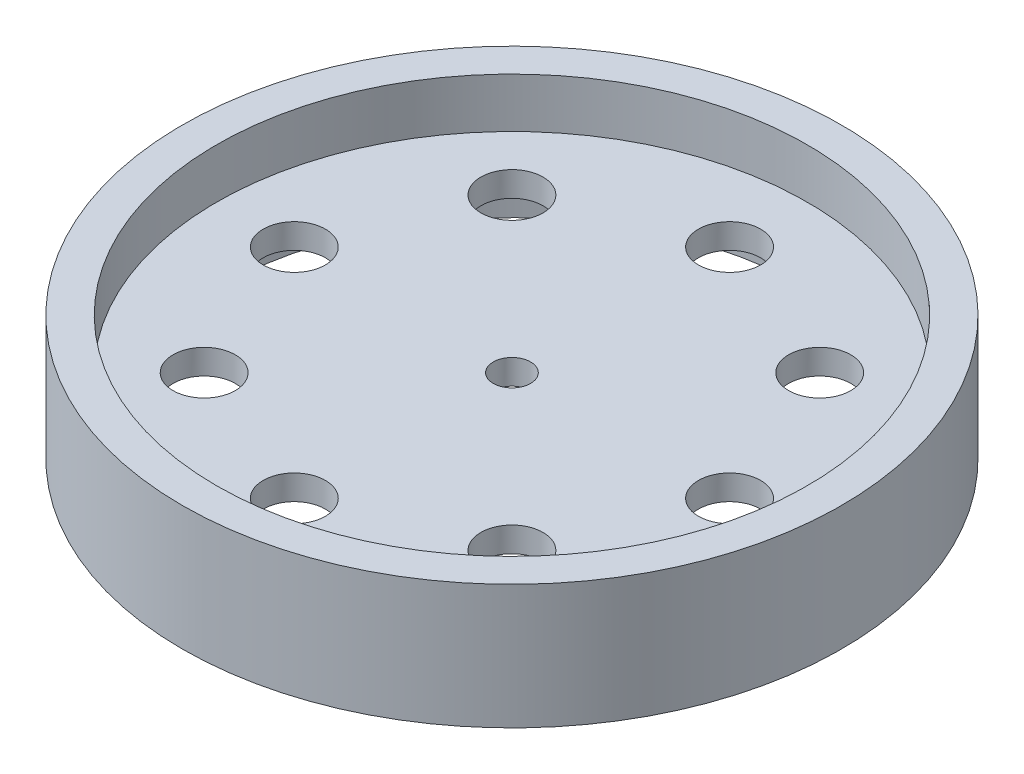
ISO-10303-21;
HEADER;
FILE_DESCRIPTION(('STEP AP214'),'2;1');
FILE_NAME('part.step','',(''),(''),'','','');
FILE_SCHEMA(('AUTOMOTIVE_DESIGN { 1 0 10303 214 1 1 1 1 }'));
ENDSEC;
DATA;
#1=APPLICATION_CONTEXT('core data for automotive mechanical design processes');
#2=APPLICATION_PROTOCOL_DEFINITION('international standard','automotive_design',2000,#1);
#3=PRODUCT_CONTEXT('',#1,'mechanical');
#4=PRODUCT('Part','Part','',(#3));
#5=PRODUCT_RELATED_PRODUCT_CATEGORY('part','',(#4));
#6=PRODUCT_DEFINITION_FORMATION('','',#4);
#7=PRODUCT_DEFINITION_CONTEXT('part definition',#1,'design');
#8=PRODUCT_DEFINITION('design','',#6,#7);
#9=PRODUCT_DEFINITION_SHAPE('','',#8);
#10=(LENGTH_UNIT() NAMED_UNIT(*) SI_UNIT(.MILLI.,.METRE.));
#11=(NAMED_UNIT(*) PLANE_ANGLE_UNIT() SI_UNIT($,.RADIAN.));
#12=(NAMED_UNIT(*) SI_UNIT($,.STERADIAN.) SOLID_ANGLE_UNIT());
#13=UNCERTAINTY_MEASURE_WITH_UNIT(LENGTH_MEASURE(1.E-05),#10,'distance_accuracy_value','');
#14=(GEOMETRIC_REPRESENTATION_CONTEXT(3) GLOBAL_UNCERTAINTY_ASSIGNED_CONTEXT((#13)) GLOBAL_UNIT_ASSIGNED_CONTEXT((#10,
#11,#12)) REPRESENTATION_CONTEXT('',''));
#15=CARTESIAN_POINT('',(0.,0.,0.));
#16=DIRECTION('',(0.,0.,1.));
#17=DIRECTION('',(1.,0.,0.));
#18=AXIS2_PLACEMENT_3D('',#15,#16,#17);
#19=CARTESIAN_POINT('',(0.,20.,0.));
#20=DIRECTION('',(0.,1.,0.));
#21=DIRECTION('',(0.,0.,1.));
#22=AXIS2_PLACEMENT_3D('',#19,#20,#21);
#23=PLANE('',#22);
#24=CARTESIAN_POINT('',(0.,20.,0.));
#25=DIRECTION('',(0.,1.,0.));
#26=DIRECTION('',(0.,0.,1.));
#27=AXIS2_PLACEMENT_3D('',#24,#25,#26);
#28=CIRCLE('',#27,47.5);
#29=CARTESIAN_POINT('',(0.,20.,47.5));
#30=VERTEX_POINT('',#29);
#31=EDGE_CURVE('E49',#30,#30,#28,.T.);
#32=ORIENTED_EDGE('',*,*,#31,.F.);
#33=EDGE_LOOP('',(#32));
#34=FACE_BOUND('',#33,.T.);
#35=CARTESIAN_POINT('',(0.,20.,0.));
#36=DIRECTION('',(0.,1.,0.));
#37=DIRECTION('',(0.,0.,1.));
#38=AXIS2_PLACEMENT_3D('',#35,#36,#37);
#39=CIRCLE('',#38,53.);
#40=CARTESIAN_POINT('',(0.,20.,53.));
#41=VERTEX_POINT('',#40);
#42=EDGE_CURVE('E10',#41,#41,#39,.T.);
#43=ORIENTED_EDGE('',*,*,#42,.T.);
#44=EDGE_LOOP('',(#43));
#45=FACE_BOUND('',#44,.T.);
#46=ADVANCED_FACE('F33',(#34,#45),#23,.T.);
#47=CARTESIAN_POINT('',(0.,0.,0.));
#48=DIRECTION('',(0.,1.,0.));
#49=DIRECTION('',(0.,0.,1.));
#50=AXIS2_PLACEMENT_3D('',#47,#48,#49);
#51=PLANE('',#50);
#52=CARTESIAN_POINT('',(0.,0.,0.));
#53=DIRECTION('',(0.,-1.,0.));
#54=DIRECTION('',(0.,0.,-1.));
#55=AXIS2_PLACEMENT_3D('',#52,#53,#54);
#56=CIRCLE('',#55,47.5);
#57=CARTESIAN_POINT('',(0.,0.,-47.5));
#58=VERTEX_POINT('',#57);
#59=EDGE_CURVE('E55',#58,#58,#56,.T.);
#60=ORIENTED_EDGE('',*,*,#59,.F.);
#61=EDGE_LOOP('',(#60));
#62=FACE_BOUND('',#61,.T.);
#63=CARTESIAN_POINT('',(0.,0.,0.));
#64=DIRECTION('',(0.,1.,0.));
#65=DIRECTION('',(0.,0.,1.));
#66=AXIS2_PLACEMENT_3D('',#63,#64,#65);
#67=CIRCLE('',#66,53.);
#68=CARTESIAN_POINT('',(0.,0.,53.));
#69=VERTEX_POINT('',#68);
#70=EDGE_CURVE('E41',#69,#69,#67,.T.);
#71=ORIENTED_EDGE('',*,*,#70,.F.);
#72=EDGE_LOOP('',(#71));
#73=FACE_BOUND('',#72,.T.);
#74=ADVANCED_FACE('F120',(#62,#73),#51,.F.);
#75=CARTESIAN_POINT('',(0.,20.,0.));
#76=DIRECTION('',(0.,-1.,0.));
#77=DIRECTION('',(0.,0.,-1.));
#78=AXIS2_PLACEMENT_3D('',#75,#76,#77);
#79=CYLINDRICAL_SURFACE('',#78,53.);
#80=ORIENTED_EDGE('',*,*,#42,.F.);
#81=EDGE_LOOP('',(#80));
#82=FACE_BOUND('',#81,.T.);
#83=ORIENTED_EDGE('',*,*,#70,.T.);
#84=EDGE_LOOP('',(#83));
#85=FACE_BOUND('',#84,.T.);
#86=ADVANCED_FACE('F35',(#82,#85),#79,.T.);
#87=CARTESIAN_POINT('',(0.,12.,0.));
#88=DIRECTION('',(0.,1.,0.));
#89=DIRECTION('',(0.,0.,1.));
#90=AXIS2_PLACEMENT_3D('',#87,#88,#89);
#91=CYLINDRICAL_SURFACE('',#90,47.5);
#92=CARTESIAN_POINT('',(0.,12.,0.));
#93=DIRECTION('',(0.,1.,0.));
#94=DIRECTION('',(0.,0.,1.));
#95=AXIS2_PLACEMENT_3D('',#92,#93,#94);
#96=CIRCLE('',#95,47.5);
#97=CARTESIAN_POINT('',(0.,12.,47.5));
#98=VERTEX_POINT('',#97);
#99=EDGE_CURVE('E46',#98,#98,#96,.T.);
#100=ORIENTED_EDGE('',*,*,#99,.F.);
#101=EDGE_LOOP('',(#100));
#102=FACE_BOUND('',#101,.T.);
#103=ORIENTED_EDGE('',*,*,#31,.T.);
#104=EDGE_LOOP('',(#103));
#105=FACE_BOUND('',#104,.T.);
#106=ADVANCED_FACE('F117',(#102,#105),#91,.F.);
#107=CARTESIAN_POINT('',(0.,12.,0.));
#108=DIRECTION('',(0.,1.,0.));
#109=DIRECTION('',(0.,0.,1.));
#110=AXIS2_PLACEMENT_3D('',#107,#108,#109);
#111=PLANE('',#110);
#112=CARTESIAN_POINT('',(-24.7487373415287,12.,-24.7487373415281));
#113=DIRECTION('',(0.,1.,0.));
#114=DIRECTION('',(0.,0.,1.));
#115=AXIS2_PLACEMENT_3D('',#112,#113,#114);
#116=CIRCLE('',#115,5.00000000000114);
#117=CARTESIAN_POINT('',(-24.7487373415287,12.,-19.748737341527));
#118=VERTEX_POINT('',#117);
#119=EDGE_CURVE('E92',#118,#118,#116,.T.);
#120=ORIENTED_EDGE('',*,*,#119,.F.);
#121=EDGE_LOOP('',(#120));
#122=FACE_BOUND('',#121,.T.);
#123=CARTESIAN_POINT('',(-34.9999999999985,12.,1.49213995743417E-12));
#124=DIRECTION('',(0.,1.,0.));
#125=DIRECTION('',(0.,0.,1.));
#126=AXIS2_PLACEMENT_3D('',#123,#124,#125);
#127=CIRCLE('',#126,5.00000000000221);
#128=CARTESIAN_POINT('',(-34.9999999999985,12.,5.00000000000371));
#129=VERTEX_POINT('',#128);
#130=EDGE_CURVE('E82',#129,#129,#127,.T.);
#131=ORIENTED_EDGE('',*,*,#130,.F.);
#132=EDGE_LOOP('',(#131));
#133=FACE_BOUND('',#132,.T.);
#134=CARTESIAN_POINT('',(-24.7487373415266,12.,24.7487373415302));
#135=DIRECTION('',(0.,1.,0.));
#136=DIRECTION('',(0.,0.,1.));
#137=AXIS2_PLACEMENT_3D('',#134,#135,#136);
#138=CIRCLE('',#137,5.00000000000303);
#139=CARTESIAN_POINT('',(-24.7487373415266,12.,29.7487373415332));
#140=VERTEX_POINT('',#139);
#141=EDGE_CURVE('E79',#140,#140,#138,.T.);
#142=ORIENTED_EDGE('',*,*,#141,.F.);
#143=EDGE_LOOP('',(#142));
#144=FACE_BOUND('',#143,.T.);
#145=CARTESIAN_POINT('',(2.9757073872743E-12,12.,35.));
#146=DIRECTION('',(0.,1.,0.));
#147=DIRECTION('',(0.,0.,1.));
#148=AXIS2_PLACEMENT_3D('',#145,#146,#147);
#149=CIRCLE('',#148,5.00000000000308);
#150=CARTESIAN_POINT('',(2.9757073872743E-12,12.,40.0000000000031));
#151=VERTEX_POINT('',#150);
#152=EDGE_CURVE('E76',#151,#151,#149,.T.);
#153=ORIENTED_EDGE('',*,*,#152,.F.);
#154=EDGE_LOOP('',(#153));
#155=FACE_BOUND('',#154,.T.);
#156=CARTESIAN_POINT('',(24.7487373415317,12.,24.7487373415281));
#157=DIRECTION('',(0.,1.,0.));
#158=DIRECTION('',(0.,0.,1.));
#159=AXIS2_PLACEMENT_3D('',#156,#157,#158);
#160=CIRCLE('',#159,5.0000000000023);
#161=CARTESIAN_POINT('',(24.7487373415317,12.,29.7487373415304));
#162=VERTEX_POINT('',#161);
#163=EDGE_CURVE('E72',#162,#162,#160,.T.);
#164=ORIENTED_EDGE('',*,*,#163,.F.);
#165=EDGE_LOOP('',(#164));
#166=FACE_BOUND('',#165,.T.);
#167=CARTESIAN_POINT('',(35.0000000000015,12.,-1.48785369363715E-12));
#168=DIRECTION('',(0.,1.,0.));
#169=DIRECTION('',(0.,0.,1.));
#170=AXIS2_PLACEMENT_3D('',#167,#168,#169);
#171=CIRCLE('',#170,5.00000000000111);
#172=CARTESIAN_POINT('',(35.0000000000015,12.,4.99999999999962));
#173=VERTEX_POINT('',#172);
#174=EDGE_CURVE('E68',#173,#173,#171,.T.);
#175=ORIENTED_EDGE('',*,*,#174,.F.);
#176=EDGE_LOOP('',(#175));
#177=FACE_BOUND('',#176,.T.);
#178=CARTESIAN_POINT('',(24.7487373415296,12.,-24.7487373415302));
#179=DIRECTION('',(0.,1.,0.));
#180=DIRECTION('',(0.,0.,1.));
#181=AXIS2_PLACEMENT_3D('',#178,#179,#180);
#182=CIRCLE('',#181,5.00000000000017);
#183=CARTESIAN_POINT('',(24.7487373415296,12.,-19.74873734153));
#184=VERTEX_POINT('',#183);
#185=EDGE_CURVE('E64',#184,#184,#182,.T.);
#186=ORIENTED_EDGE('',*,*,#185,.F.);
#187=EDGE_LOOP('',(#186));
#188=FACE_BOUND('',#187,.T.);
#189=CARTESIAN_POINT('',(0.,12.,-35.));
#190=DIRECTION('',(0.,1.,0.));
#191=DIRECTION('',(0.,0.,1.));
#192=AXIS2_PLACEMENT_3D('',#189,#190,#191);
#193=CIRCLE('',#192,5.);
#194=CARTESIAN_POINT('',(0.,12.,-30.));
#195=VERTEX_POINT('',#194);
#196=EDGE_CURVE('E60',#195,#195,#193,.T.);
#197=ORIENTED_EDGE('',*,*,#196,.F.);
#198=EDGE_LOOP('',(#197));
#199=FACE_BOUND('',#198,.T.);
#200=CARTESIAN_POINT('',(0.,12.,0.));
#201=DIRECTION('',(0.,1.,0.));
#202=DIRECTION('',(0.,0.,1.));
#203=AXIS2_PLACEMENT_3D('',#200,#201,#202);
#204=CIRCLE('',#203,3.);
#205=CARTESIAN_POINT('',(0.,12.,3.));
#206=VERTEX_POINT('',#205);
#207=EDGE_CURVE('E56',#206,#206,#204,.T.);
#208=ORIENTED_EDGE('',*,*,#207,.F.);
#209=EDGE_LOOP('',(#208));
#210=FACE_BOUND('',#209,.T.);
#211=ORIENTED_EDGE('',*,*,#99,.T.);
#212=EDGE_LOOP('',(#211));
#213=FACE_BOUND('',#212,.T.);
#214=ADVANCED_FACE('F129',(#122,#133,#144,#155,#166,#177,#188,#199,#210,#213),#111,.T.);
#215=CARTESIAN_POINT('',(0.,8.,0.));
#216=DIRECTION('',(0.,-1.,0.));
#217=DIRECTION('',(0.,0.,-1.));
#218=AXIS2_PLACEMENT_3D('',#215,#216,#217);
#219=CYLINDRICAL_SURFACE('',#218,47.5);
#220=CARTESIAN_POINT('',(0.,8.,0.));
#221=DIRECTION('',(0.,-1.,0.));
#222=DIRECTION('',(0.,0.,-1.));
#223=AXIS2_PLACEMENT_3D('',#220,#221,#222);
#224=CIRCLE('',#223,47.5);
#225=CARTESIAN_POINT('',(0.,8.,-47.5));
#226=VERTEX_POINT('',#225);
#227=EDGE_CURVE('E107',#226,#226,#224,.T.);
#228=ORIENTED_EDGE('',*,*,#227,.F.);
#229=EDGE_LOOP('',(#228));
#230=FACE_BOUND('',#229,.T.);
#231=ORIENTED_EDGE('',*,*,#59,.T.);
#232=EDGE_LOOP('',(#231));
#233=FACE_BOUND('',#232,.T.);
#234=ADVANCED_FACE('F133',(#230,#233),#219,.F.);
#235=CARTESIAN_POINT('',(0.,8.,0.));
#236=DIRECTION('',(0.,-1.,0.));
#237=DIRECTION('',(0.,0.,-1.));
#238=AXIS2_PLACEMENT_3D('',#235,#236,#237);
#239=PLANE('',#238);
#240=CARTESIAN_POINT('',(-24.7487373415287,8.,-24.7487373415281));
#241=DIRECTION('',(0.,-1.,0.));
#242=DIRECTION('',(0.,0.,-1.));
#243=AXIS2_PLACEMENT_3D('',#240,#241,#242);
#244=CIRCLE('',#243,5.00000000000114);
#245=CARTESIAN_POINT('',(-24.7487373415287,8.,-29.7487373415292));
#246=VERTEX_POINT('',#245);
#247=EDGE_CURVE('E37',#246,#246,#244,.T.);
#248=ORIENTED_EDGE('',*,*,#247,.F.);
#249=EDGE_LOOP('',(#248));
#250=FACE_BOUND('',#249,.T.);
#251=CARTESIAN_POINT('',(-34.9999999999985,8.,1.49213995743417E-12));
#252=DIRECTION('',(0.,-1.,0.));
#253=DIRECTION('',(0.,0.,-1.));
#254=AXIS2_PLACEMENT_3D('',#251,#252,#253);
#255=CIRCLE('',#254,5.00000000000221);
#256=CARTESIAN_POINT('',(-34.9999999999985,8.,-5.00000000000072));
#257=VERTEX_POINT('',#256);
#258=EDGE_CURVE('E80',#257,#257,#255,.T.);
#259=ORIENTED_EDGE('',*,*,#258,.F.);
#260=EDGE_LOOP('',(#259));
#261=FACE_BOUND('',#260,.T.);
#262=CARTESIAN_POINT('',(-24.7487373415266,8.,24.7487373415302));
#263=DIRECTION('',(0.,-1.,0.));
#264=DIRECTION('',(0.,0.,-1.));
#265=AXIS2_PLACEMENT_3D('',#262,#263,#264);
#266=CIRCLE('',#265,5.00000000000303);
#267=CARTESIAN_POINT('',(-24.7487373415266,8.,19.7487373415272));
#268=VERTEX_POINT('',#267);
#269=EDGE_CURVE('E77',#268,#268,#266,.T.);
#270=ORIENTED_EDGE('',*,*,#269,.F.);
#271=EDGE_LOOP('',(#270));
#272=FACE_BOUND('',#271,.T.);
#273=CARTESIAN_POINT('',(2.9757073872743E-12,8.,35.));
#274=DIRECTION('',(0.,-1.,0.));
#275=DIRECTION('',(0.,0.,-1.));
#276=AXIS2_PLACEMENT_3D('',#273,#274,#275);
#277=CIRCLE('',#276,5.00000000000308);
#278=CARTESIAN_POINT('',(2.9757073872743E-12,8.,29.9999999999969));
#279=VERTEX_POINT('',#278);
#280=EDGE_CURVE('E73',#279,#279,#277,.T.);
#281=ORIENTED_EDGE('',*,*,#280,.F.);
#282=EDGE_LOOP('',(#281));
#283=FACE_BOUND('',#282,.T.);
#284=CARTESIAN_POINT('',(24.7487373415317,8.,24.7487373415281));
#285=DIRECTION('',(0.,-1.,0.));
#286=DIRECTION('',(0.,0.,-1.));
#287=AXIS2_PLACEMENT_3D('',#284,#285,#286);
#288=CIRCLE('',#287,5.0000000000023);
#289=CARTESIAN_POINT('',(24.7487373415317,8.,19.7487373415258));
#290=VERTEX_POINT('',#289);
#291=EDGE_CURVE('E69',#290,#290,#288,.T.);
#292=ORIENTED_EDGE('',*,*,#291,.F.);
#293=EDGE_LOOP('',(#292));
#294=FACE_BOUND('',#293,.T.);
#295=CARTESIAN_POINT('',(35.0000000000015,8.,-1.48785369363715E-12));
#296=DIRECTION('',(0.,-1.,0.));
#297=DIRECTION('',(0.,0.,-1.));
#298=AXIS2_PLACEMENT_3D('',#295,#296,#297);
#299=CIRCLE('',#298,5.00000000000111);
#300=CARTESIAN_POINT('',(35.0000000000015,8.,-5.00000000000259));
#301=VERTEX_POINT('',#300);
#302=EDGE_CURVE('E65',#301,#301,#299,.T.);
#303=ORIENTED_EDGE('',*,*,#302,.F.);
#304=EDGE_LOOP('',(#303));
#305=FACE_BOUND('',#304,.T.);
#306=CARTESIAN_POINT('',(24.7487373415296,8.,-24.7487373415302));
#307=DIRECTION('',(0.,-1.,0.));
#308=DIRECTION('',(0.,0.,-1.));
#309=AXIS2_PLACEMENT_3D('',#306,#307,#308);
#310=CIRCLE('',#309,5.00000000000017);
#311=CARTESIAN_POINT('',(24.7487373415296,8.,-29.7487373415304));
#312=VERTEX_POINT('',#311);
#313=EDGE_CURVE('E61',#312,#312,#310,.T.);
#314=ORIENTED_EDGE('',*,*,#313,.F.);
#315=EDGE_LOOP('',(#314));
#316=FACE_BOUND('',#315,.T.);
#317=CARTESIAN_POINT('',(0.,8.,-35.));
#318=DIRECTION('',(0.,-1.,0.));
#319=DIRECTION('',(0.,0.,-1.));
#320=AXIS2_PLACEMENT_3D('',#317,#318,#319);
#321=CIRCLE('',#320,5.);
#322=CARTESIAN_POINT('',(0.,8.,-40.));
#323=VERTEX_POINT('',#322);
#324=EDGE_CURVE('E57',#323,#323,#321,.T.);
#325=ORIENTED_EDGE('',*,*,#324,.F.);
#326=EDGE_LOOP('',(#325));
#327=FACE_BOUND('',#326,.T.);
#328=CARTESIAN_POINT('',(0.,8.,0.));
#329=DIRECTION('',(0.,-1.,0.));
#330=DIRECTION('',(0.,0.,-1.));
#331=AXIS2_PLACEMENT_3D('',#328,#329,#330);
#332=CIRCLE('',#331,3.);
#333=CARTESIAN_POINT('',(0.,8.,-3.));
#334=VERTEX_POINT('',#333);
#335=EDGE_CURVE('E52',#334,#334,#332,.T.);
#336=ORIENTED_EDGE('',*,*,#335,.F.);
#337=EDGE_LOOP('',(#336));
#338=FACE_BOUND('',#337,.T.);
#339=ORIENTED_EDGE('',*,*,#227,.T.);
#340=EDGE_LOOP('',(#339));
#341=FACE_BOUND('',#340,.T.);
#342=ADVANCED_FACE('F137',(#250,#261,#272,#283,#294,#305,#316,#327,#338,#341),#239,.T.);
#343=CARTESIAN_POINT('',(0.,0.,0.));
#344=DIRECTION('',(0.,1.,0.));
#345=DIRECTION('',(0.,0.,1.));
#346=AXIS2_PLACEMENT_3D('',#343,#344,#345);
#347=CYLINDRICAL_SURFACE('',#346,3.);
#348=ORIENTED_EDGE('',*,*,#335,.T.);
#349=EDGE_LOOP('',(#348));
#350=FACE_BOUND('',#349,.T.);
#351=ORIENTED_EDGE('',*,*,#207,.T.);
#352=EDGE_LOOP('',(#351));
#353=FACE_BOUND('',#352,.T.);
#354=ADVANCED_FACE('F141',(#350,#353),#347,.F.);
#355=CARTESIAN_POINT('',(0.,0.,-35.));
#356=DIRECTION('',(0.,1.,0.));
#357=DIRECTION('',(0.,0.,1.));
#358=AXIS2_PLACEMENT_3D('',#355,#356,#357);
#359=CYLINDRICAL_SURFACE('',#358,5.);
#360=ORIENTED_EDGE('',*,*,#324,.T.);
#361=EDGE_LOOP('',(#360));
#362=FACE_BOUND('',#361,.T.);
#363=ORIENTED_EDGE('',*,*,#196,.T.);
#364=EDGE_LOOP('',(#363));
#365=FACE_BOUND('',#364,.T.);
#366=ADVANCED_FACE('F145',(#362,#365),#359,.F.);
#367=CARTESIAN_POINT('',(24.7487373415296,0.,-24.7487373415302));
#368=DIRECTION('',(0.,1.,0.));
#369=DIRECTION('',(0.,0.,1.));
#370=AXIS2_PLACEMENT_3D('',#367,#368,#369);
#371=CYLINDRICAL_SURFACE('',#370,5.00000000000017);
#372=ORIENTED_EDGE('',*,*,#313,.T.);
#373=EDGE_LOOP('',(#372));
#374=FACE_BOUND('',#373,.T.);
#375=ORIENTED_EDGE('',*,*,#185,.T.);
#376=EDGE_LOOP('',(#375));
#377=FACE_BOUND('',#376,.T.);
#378=ADVANCED_FACE('F149',(#374,#377),#371,.F.);
#379=CARTESIAN_POINT('',(35.0000000000015,0.,-1.48785369363715E-12));
#380=DIRECTION('',(0.,1.,0.));
#381=DIRECTION('',(0.,0.,1.));
#382=AXIS2_PLACEMENT_3D('',#379,#380,#381);
#383=CYLINDRICAL_SURFACE('',#382,5.00000000000111);
#384=ORIENTED_EDGE('',*,*,#302,.T.);
#385=EDGE_LOOP('',(#384));
#386=FACE_BOUND('',#385,.T.);
#387=ORIENTED_EDGE('',*,*,#174,.T.);
#388=EDGE_LOOP('',(#387));
#389=FACE_BOUND('',#388,.T.);
#390=ADVANCED_FACE('F153',(#386,#389),#383,.F.);
#391=CARTESIAN_POINT('',(24.7487373415317,0.,24.7487373415281));
#392=DIRECTION('',(0.,1.,0.));
#393=DIRECTION('',(0.,0.,1.));
#394=AXIS2_PLACEMENT_3D('',#391,#392,#393);
#395=CYLINDRICAL_SURFACE('',#394,5.0000000000023);
#396=ORIENTED_EDGE('',*,*,#291,.T.);
#397=EDGE_LOOP('',(#396));
#398=FACE_BOUND('',#397,.T.);
#399=ORIENTED_EDGE('',*,*,#163,.T.);
#400=EDGE_LOOP('',(#399));
#401=FACE_BOUND('',#400,.T.);
#402=ADVANCED_FACE('F157',(#398,#401),#395,.F.);
#403=CARTESIAN_POINT('',(2.9757073872743E-12,0.,35.));
#404=DIRECTION('',(0.,1.,0.));
#405=DIRECTION('',(0.,0.,1.));
#406=AXIS2_PLACEMENT_3D('',#403,#404,#405);
#407=CYLINDRICAL_SURFACE('',#406,5.00000000000308);
#408=ORIENTED_EDGE('',*,*,#280,.T.);
#409=EDGE_LOOP('',(#408));
#410=FACE_BOUND('',#409,.T.);
#411=ORIENTED_EDGE('',*,*,#152,.T.);
#412=EDGE_LOOP('',(#411));
#413=FACE_BOUND('',#412,.T.);
#414=ADVANCED_FACE('F161',(#410,#413),#407,.F.);
#415=CARTESIAN_POINT('',(-24.7487373415266,0.,24.7487373415302));
#416=DIRECTION('',(0.,1.,0.));
#417=DIRECTION('',(0.,0.,1.));
#418=AXIS2_PLACEMENT_3D('',#415,#416,#417);
#419=CYLINDRICAL_SURFACE('',#418,5.00000000000303);
#420=ORIENTED_EDGE('',*,*,#269,.T.);
#421=EDGE_LOOP('',(#420));
#422=FACE_BOUND('',#421,.T.);
#423=ORIENTED_EDGE('',*,*,#141,.T.);
#424=EDGE_LOOP('',(#423));
#425=FACE_BOUND('',#424,.T.);
#426=ADVANCED_FACE('F165',(#422,#425),#419,.F.);
#427=CARTESIAN_POINT('',(-34.9999999999985,0.,1.49213995743417E-12));
#428=DIRECTION('',(0.,1.,0.));
#429=DIRECTION('',(0.,0.,1.));
#430=AXIS2_PLACEMENT_3D('',#427,#428,#429);
#431=CYLINDRICAL_SURFACE('',#430,5.00000000000221);
#432=ORIENTED_EDGE('',*,*,#258,.T.);
#433=EDGE_LOOP('',(#432));
#434=FACE_BOUND('',#433,.T.);
#435=ORIENTED_EDGE('',*,*,#130,.T.);
#436=EDGE_LOOP('',(#435));
#437=FACE_BOUND('',#436,.T.);
#438=ADVANCED_FACE('F169',(#434,#437),#431,.F.);
#439=CARTESIAN_POINT('',(-24.7487373415287,0.,-24.7487373415281));
#440=DIRECTION('',(0.,1.,0.));
#441=DIRECTION('',(0.,0.,1.));
#442=AXIS2_PLACEMENT_3D('',#439,#440,#441);
#443=CYLINDRICAL_SURFACE('',#442,5.00000000000114);
#444=ORIENTED_EDGE('',*,*,#247,.T.);
#445=EDGE_LOOP('',(#444));
#446=FACE_BOUND('',#445,.T.);
#447=ORIENTED_EDGE('',*,*,#119,.T.);
#448=EDGE_LOOP('',(#447));
#449=FACE_BOUND('',#448,.T.);
#450=ADVANCED_FACE('F173',(#446,#449),#443,.F.);
#451=CLOSED_SHELL('',(#46,#74,#86,#106,#214,#234,#342,#354,#366,#378,#390,#402,#414,#426,#438,#450));
#452=MANIFOLD_SOLID_BREP('B2',#451);
#453=ADVANCED_BREP_SHAPE_REPRESENTATION('',(#18,#452),#14);
#454=SHAPE_DEFINITION_REPRESENTATION(#9,#453);
ENDSEC;
END-ISO-10303-21;
